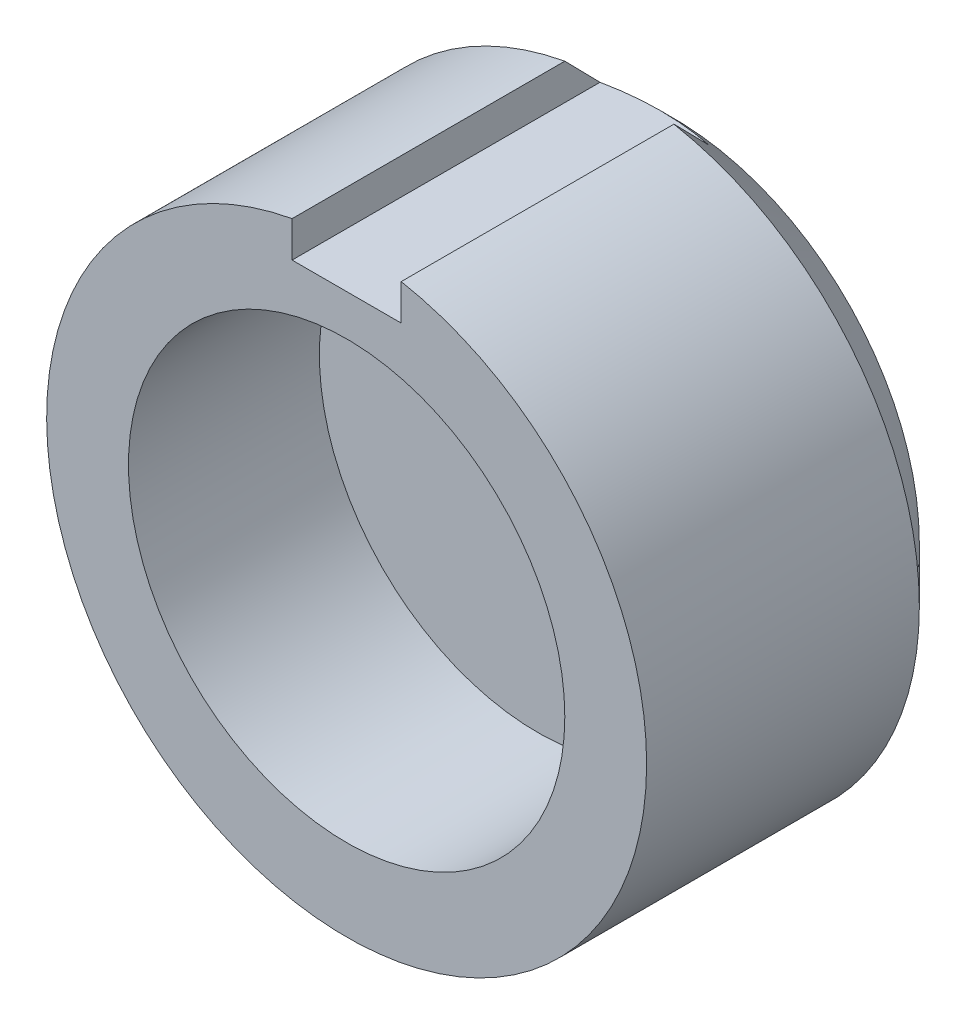
ISO-10303-21;
HEADER;
FILE_DESCRIPTION(('STEP AP214'),'2;1');
FILE_NAME('part.step','',(''),(''),'','','');
FILE_SCHEMA(('AUTOMOTIVE_DESIGN { 1 0 10303 214 1 1 1 1 }'));
ENDSEC;
DATA;
#1=APPLICATION_CONTEXT('core data for automotive mechanical design processes');
#2=APPLICATION_PROTOCOL_DEFINITION('international standard','automotive_design',2000,#1);
#3=PRODUCT_CONTEXT('',#1,'mechanical');
#4=PRODUCT('Part','Part','',(#3));
#5=PRODUCT_RELATED_PRODUCT_CATEGORY('part','',(#4));
#6=PRODUCT_DEFINITION_FORMATION('','',#4);
#7=PRODUCT_DEFINITION_CONTEXT('part definition',#1,'design');
#8=PRODUCT_DEFINITION('design','',#6,#7);
#9=PRODUCT_DEFINITION_SHAPE('','',#8);
#10=(LENGTH_UNIT() NAMED_UNIT(*) SI_UNIT(.MILLI.,.METRE.));
#11=(NAMED_UNIT(*) PLANE_ANGLE_UNIT() SI_UNIT($,.RADIAN.));
#12=(NAMED_UNIT(*) SI_UNIT($,.STERADIAN.) SOLID_ANGLE_UNIT());
#13=UNCERTAINTY_MEASURE_WITH_UNIT(LENGTH_MEASURE(1.E-05),#10,'distance_accuracy_value','');
#14=(GEOMETRIC_REPRESENTATION_CONTEXT(3) GLOBAL_UNCERTAINTY_ASSIGNED_CONTEXT((#13)) GLOBAL_UNIT_ASSIGNED_CONTEXT((#10,
#11,#12)) REPRESENTATION_CONTEXT('',''));
#15=CARTESIAN_POINT('',(0.,0.,0.));
#16=DIRECTION('',(0.,0.,1.));
#17=DIRECTION('',(1.,0.,0.));
#18=AXIS2_PLACEMENT_3D('',#15,#16,#17);
#19=CARTESIAN_POINT('',(0.,0.,12.));
#20=DIRECTION('',(0.,0.,-1.));
#21=DIRECTION('',(-1.,0.,0.));
#22=AXIS2_PLACEMENT_3D('',#19,#20,#21);
#23=CYLINDRICAL_SURFACE('',#22,11.);
#24=CARTESIAN_POINT('',(0.,0.,1.99999999999999));
#25=DIRECTION('',(0.,0.,1.));
#26=DIRECTION('',(1.,0.,0.));
#27=AXIS2_PLACEMENT_3D('',#24,#25,#26);
#28=CIRCLE('',#27,11.);
#29=CARTESIAN_POINT('',(-2.,10.816653826392,2.));
#30=VERTEX_POINT('',#29);
#31=CARTESIAN_POINT('',(2.,10.816653826392,2.));
#32=VERTEX_POINT('',#31);
#33=EDGE_CURVE('E110',#30,#32,#28,.T.);
#34=ORIENTED_EDGE('',*,*,#33,.T.);
#35=DIRECTION('',(0.,0.,-1.));
#36=VECTOR('',#35,1.);
#37=CARTESIAN_POINT('',(2.,10.816653826392,12.));
#38=LINE('',#37,#36);
#39=CARTESIAN_POINT('',(2.,10.816653826392,12.));
#40=VERTEX_POINT('',#39);
#41=EDGE_CURVE('E58',#32,#40,#38,.F.);
#42=ORIENTED_EDGE('',*,*,#41,.T.);
#43=CARTESIAN_POINT('',(0.,0.,12.));
#44=DIRECTION('',(0.,0.,1.));
#45=DIRECTION('',(1.,0.,0.));
#46=AXIS2_PLACEMENT_3D('',#43,#44,#45);
#47=CIRCLE('',#46,11.);
#48=CARTESIAN_POINT('',(-2.,10.816653826392,12.));
#49=VERTEX_POINT('',#48);
#50=EDGE_CURVE('E106',#49,#40,#47,.T.);
#51=ORIENTED_EDGE('',*,*,#50,.F.);
#52=DIRECTION('',(0.,0.,-1.));
#53=VECTOR('',#52,1.);
#54=CARTESIAN_POINT('',(-2.,10.816653826392,12.));
#55=LINE('',#54,#53);
#56=EDGE_CURVE('E88',#49,#30,#55,.T.);
#57=ORIENTED_EDGE('',*,*,#56,.T.);
#58=EDGE_LOOP('',(#34,#42,#51,#57));
#59=FACE_BOUND('',#58,.T.);
#60=ADVANCED_FACE('F31',(#59),#23,.T.);
#61=CARTESIAN_POINT('',(0.,0.,12.));
#62=DIRECTION('',(0.,0.,1.));
#63=DIRECTION('',(1.,0.,0.));
#64=AXIS2_PLACEMENT_3D('',#61,#62,#63);
#65=PLANE('',#64);
#66=DIRECTION('',(0.,1.,0.));
#67=VECTOR('',#66,1.);
#68=CARTESIAN_POINT('',(2.,12.7888938082208,12.));
#69=LINE('',#68,#67);
#70=CARTESIAN_POINT('',(2.,9.5,12.));
#71=VERTEX_POINT('',#70);
#72=EDGE_CURVE('E92',#71,#40,#69,.T.);
#73=ORIENTED_EDGE('',*,*,#72,.F.);
#74=DIRECTION('',(1.,0.,0.));
#75=VECTOR('',#74,1.);
#76=CARTESIAN_POINT('',(2.,9.5,12.));
#77=LINE('',#76,#75);
#78=CARTESIAN_POINT('',(-2.,9.5,12.));
#79=VERTEX_POINT('',#78);
#80=EDGE_CURVE('E78',#79,#71,#77,.T.);
#81=ORIENTED_EDGE('',*,*,#80,.F.);
#82=DIRECTION('',(0.,-1.,0.));
#83=VECTOR('',#82,1.);
#84=CARTESIAN_POINT('',(-2.,12.7888938082208,12.));
#85=LINE('',#84,#83);
#86=EDGE_CURVE('E85',#49,#79,#85,.T.);
#87=ORIENTED_EDGE('',*,*,#86,.F.);
#88=ORIENTED_EDGE('',*,*,#50,.T.);
#89=EDGE_LOOP('',(#73,#81,#87,#88));
#90=FACE_BOUND('',#89,.T.);
#91=CARTESIAN_POINT('',(0.,0.,12.));
#92=DIRECTION('',(0.,0.,1.));
#93=DIRECTION('',(1.,0.,0.));
#94=AXIS2_PLACEMENT_3D('',#91,#92,#93);
#95=CIRCLE('',#94,8.);
#96=CARTESIAN_POINT('',(8.,0.,12.));
#97=VERTEX_POINT('',#96);
#98=EDGE_CURVE('E102',#97,#97,#95,.T.);
#99=ORIENTED_EDGE('',*,*,#98,.F.);
#100=EDGE_LOOP('',(#99));
#101=FACE_BOUND('',#100,.T.);
#102=ADVANCED_FACE('F94',(#90,#101),#65,.T.);
#103=CARTESIAN_POINT('',(0.,0.,0.));
#104=DIRECTION('',(0.,0.,1.));
#105=DIRECTION('',(1.,0.,0.));
#106=AXIS2_PLACEMENT_3D('',#103,#104,#105);
#107=PLANE('',#106);
#108=CARTESIAN_POINT('',(0.,0.,0.));
#109=DIRECTION('',(0.,0.,1.));
#110=DIRECTION('',(1.,0.,0.));
#111=AXIS2_PLACEMENT_3D('',#108,#109,#110);
#112=CIRCLE('',#111,9.);
#113=CARTESIAN_POINT('',(9.,0.,0.));
#114=VERTEX_POINT('',#113);
#115=EDGE_CURVE('E113',#114,#114,#112,.F.);
#116=ORIENTED_EDGE('',*,*,#115,.T.);
#117=EDGE_LOOP('',(#116));
#118=FACE_BOUND('',#117,.T.);
#119=ADVANCED_FACE('F139',(#118),#107,.F.);
#120=CARTESIAN_POINT('',(0.,0.,5.));
#121=DIRECTION('',(0.,0.,1.));
#122=DIRECTION('',(1.,0.,0.));
#123=AXIS2_PLACEMENT_3D('',#120,#121,#122);
#124=CYLINDRICAL_SURFACE('',#123,8.);
#125=CARTESIAN_POINT('',(0.,0.,5.));
#126=DIRECTION('',(0.,0.,1.));
#127=DIRECTION('',(1.,0.,0.));
#128=AXIS2_PLACEMENT_3D('',#125,#126,#127);
#129=CIRCLE('',#128,8.);
#130=CARTESIAN_POINT('',(8.,0.,5.));
#131=VERTEX_POINT('',#130);
#132=EDGE_CURVE('E103',#131,#131,#129,.T.);
#133=ORIENTED_EDGE('',*,*,#132,.F.);
#134=EDGE_LOOP('',(#133));
#135=FACE_BOUND('',#134,.T.);
#136=ORIENTED_EDGE('',*,*,#98,.T.);
#137=EDGE_LOOP('',(#136));
#138=FACE_BOUND('',#137,.T.);
#139=ADVANCED_FACE('F135',(#135,#138),#124,.F.);
#140=CARTESIAN_POINT('',(0.,0.,5.));
#141=DIRECTION('',(0.,0.,1.));
#142=DIRECTION('',(1.,0.,0.));
#143=AXIS2_PLACEMENT_3D('',#140,#141,#142);
#144=PLANE('',#143);
#145=ORIENTED_EDGE('',*,*,#132,.T.);
#146=EDGE_LOOP('',(#145));
#147=FACE_BOUND('',#146,.T.);
#148=ADVANCED_FACE('F132',(#147),#144,.T.);
#149=CARTESIAN_POINT('',(0.,0.,1.99999999999999));
#150=DIRECTION('',(0.,0.,1.));
#151=DIRECTION('',(1.,0.,0.));
#152=AXIS2_PLACEMENT_3D('',#149,#150,#151);
#153=CONICAL_SURFACE('',#152,11.,0.78539816339745);
#154=CARTESIAN_POINT('',(2.,13.0974880511047,4.24930916119143));
#155=CARTESIAN_POINT('',(2.,12.8159307876153,3.97097974284897));
#156=CARTESIAN_POINT('',(2.,12.5342734921716,3.69275160117052));
#157=CARTESIAN_POINT('',(2.,11.9707084676393,3.13654844636593));
#158=CARTESIAN_POINT('',(2.,11.688800738269,2.85857343352535));
#159=CARTESIAN_POINT('',(2.,10.8426369736835,2.02511442373821));
#160=CARTESIAN_POINT('',(2.,10.277930705385,1.47008690273645));
#161=CARTESIAN_POINT('',(2.,9.42941732832977,0.639020349159754));
#162=CARTESIAN_POINT('',(2.,9.14633481760593,0.362241628748049));
#163=CARTESIAN_POINT('',(2.,8.57953184175381,-0.190660827257916));
#164=CARTESIAN_POINT('',(2.,8.29581137800307,-0.466784564263855));
#165=CARTESIAN_POINT('',(2.,7.7275156441118,-1.01816142864535));
#166=CARTESIAN_POINT('',(2.,7.44294035959766,-1.29341454121996));
#167=CARTESIAN_POINT('',(2.,7.01519443835612,-1.70537960091689));
#168=CARTESIAN_POINT('',(2.,6.87246477745528,-1.84254935050856));
#169=CARTESIAN_POINT('',(2.,6.58665006090071,-2.11651862088132));
#170=CARTESIAN_POINT('',(2.,6.44356500451737,-2.25331814090115));
#171=CARTESIAN_POINT('',(2.,6.30027184088472,-2.38989975347991));
#172=B_SPLINE_CURVE_WITH_KNOTS('',3,(#154,#155,#156,#157,#158,#159,#160,#161,#162,#163,#164,
#165,#166,#167,#168,#169,#170,#171),.UNSPECIFIED.,.F.,.F.,(4,2,2,2,2,2,2,2,4),(0.,
1.18771856775746,2.37543847377036,4.75083753595856,5.9385570650255,7.1262740318839,
8.31401108300129,8.90788393417324,9.50175800554577),.UNSPECIFIED.);
#173=CARTESIAN_POINT('',(2.,9.5,0.708243919473798));
#174=VERTEX_POINT('',#173);
#175=EDGE_CURVE('E11',#32,#174,#172,.T.);
#176=ORIENTED_EDGE('',*,*,#175,.F.);
#177=ORIENTED_EDGE('',*,*,#33,.F.);
#178=CARTESIAN_POINT('',(-2.,6.30027184088472,-2.38989975347991));
#179=CARTESIAN_POINT('',(-2.,6.44356500451737,-2.25331814090115));
#180=CARTESIAN_POINT('',(-2.,6.58665006090071,-2.11651862088132));
#181=CARTESIAN_POINT('',(-2.,6.87246477745528,-1.84254935050856));
#182=CARTESIAN_POINT('',(-2.,7.01519443835612,-1.70537960091689));
#183=CARTESIAN_POINT('',(-2.,7.44294035959766,-1.29341454121996));
#184=CARTESIAN_POINT('',(-2.,7.72751564411181,-1.01816142864535));
#185=CARTESIAN_POINT('',(-2.,8.29581137800307,-0.466784564263854));
#186=CARTESIAN_POINT('',(-2.,8.57953184175381,-0.190660827257915));
#187=CARTESIAN_POINT('',(-2.,9.14633481760594,0.362241628748049));
#188=CARTESIAN_POINT('',(-2.,9.42941732832978,0.639020349159754));
#189=CARTESIAN_POINT('',(-2.,10.277930705385,1.47008690273645));
#190=CARTESIAN_POINT('',(-2.,10.8426369736835,2.02511442373821));
#191=CARTESIAN_POINT('',(-2.,11.688800738269,2.85857343352535));
#192=CARTESIAN_POINT('',(-2.,11.9707084676393,3.13654844636593));
#193=CARTESIAN_POINT('',(-2.,12.5342734921716,3.69275160117052));
#194=CARTESIAN_POINT('',(-2.,12.8159307876153,3.97097974284897));
#195=CARTESIAN_POINT('',(-2.,13.0974880511047,4.24930916119143));
#196=B_SPLINE_CURVE_WITH_KNOTS('',3,(#178,#179,#180,#181,#182,#183,#184,#185,#186,#187,#188,
#189,#190,#191,#192,#193,#194,#195),.UNSPECIFIED.,.F.,.F.,(4,2,2,2,2,2,2,2,4),(0.,
0.593874071372526,1.18774692254448,2.37548397366187,3.56320094052027,4.75092046958721,
7.12631953177541,8.3140394377883,9.50175800554577),.UNSPECIFIED.);
#197=CARTESIAN_POINT('',(-2.,9.5,0.708243919473798));
#198=VERTEX_POINT('',#197);
#199=EDGE_CURVE('E116',#198,#30,#196,.T.);
#200=ORIENTED_EDGE('',*,*,#199,.F.);
#201=CARTESIAN_POINT('',(-5.38113015204852,9.5,1.91817575024718));
#202=CARTESIAN_POINT('',(-5.22685160857139,9.5,1.84214516994381));
#203=CARTESIAN_POINT('',(-5.07159937127521,9.5,1.76809601627));
#204=CARTESIAN_POINT('',(-4.75900161160943,9.5,1.62444276859623));
#205=CARTESIAN_POINT('',(-4.60165551328501,9.5,1.5548399295063));
#206=CARTESIAN_POINT('',(-4.12542546984935,9.5,1.35307932593605));
#207=CARTESIAN_POINT('',(-3.80328642988758,9.5,1.22843791410233));
#208=CARTESIAN_POINT('',(-3.15201279527071,9.5,1.00460892365905));
#209=CARTESIAN_POINT('',(-2.82292174222955,9.5,0.905295984900183));
#210=CARTESIAN_POINT('',(-2.15744437537467,9.5,0.736599182284544));
#211=CARTESIAN_POINT('',(-1.82106865439673,9.5,0.66717457198463));
#212=CARTESIAN_POINT('',(-1.24674114783848,9.5,0.578631827967843));
#213=CARTESIAN_POINT('',(-1.01014410886521,9.5,0.55062233619619));
#214=CARTESIAN_POINT('',(-0.535471099976397,9.5,0.512140485204254));
#215=CARTESIAN_POINT('',(-0.297394962049656,9.5,0.501670156219264));
#216=CARTESIAN_POINT('',(0.178839081619706,9.5,0.4986997207023));
#217=CARTESIAN_POINT('',(0.416996972156076,9.5,0.506197209500821));
#218=CARTESIAN_POINT('',(0.892041762003422,9.5,0.53884367836454));
#219=CARTESIAN_POINT('',(1.12892881447049,9.5,0.563990480961212));
#220=CARTESIAN_POINT('',(1.70895932023167,9.5,0.646479892690164));
#221=CARTESIAN_POINT('',(2.05077256092503,9.5,0.713318207347682));
#222=CARTESIAN_POINT('',(2.72710557519324,9.5,0.878213596109495));
#223=CARTESIAN_POINT('',(3.0616139795311,9.5,0.976316077816861));
#224=CARTESIAN_POINT('',(3.72391716333536,9.5,1.19900122700088));
#225=CARTESIAN_POINT('',(4.05165721068185,9.5,1.32374487961077));
#226=CARTESIAN_POINT('',(4.53602799834676,9.5,1.52635441519168));
#227=CARTESIAN_POINT('',(4.69602774575947,9.5,1.59634876891674));
#228=CARTESIAN_POINT('',(5.01385684642412,9.5,1.74098608732262));
#229=CARTESIAN_POINT('',(5.1716868384797,9.5,1.81562764640481));
#230=CARTESIAN_POINT('',(5.32850835513373,9.5,1.89233681496904));
#231=B_SPLINE_CURVE_WITH_KNOTS('',3,(#201,#202,#203,#204,#205,#206,#207,#208,#209,#210,#211,
#212,#213,#214,#215,#216,#217,#218,#219,#220,#221,#222,#223,#224,#225,#226,#227,#228,#229,#230),
.UNSPECIFIED.,.F.,.F.,(4,2,2,2,2,2,2,2,2,2,2,2,2,2,4),(0.,0.515960047261856,1.0320650794441,
2.06741192628774,3.09753040167932,4.12624004577137,4.84039839219381,5.55463939987734,
6.26878482457606,6.98284215769706,8.0258948018208,9.07046931726087,10.1215441383317,
10.6454052526886,11.1691086820388),.UNSPECIFIED.);
#232=EDGE_CURVE('E44',#174,#198,#231,.F.);
#233=ORIENTED_EDGE('',*,*,#232,.F.);
#234=EDGE_LOOP('',(#176,#177,#200,#233));
#235=FACE_BOUND('',#234,.T.);
#236=ORIENTED_EDGE('',*,*,#115,.F.);
#237=EDGE_LOOP('',(#236));
#238=FACE_BOUND('',#237,.T.);
#239=ADVANCED_FACE('F33',(#235,#238),#153,.T.);
#240=CARTESIAN_POINT('',(2.,12.7888938082208,-10.));
#241=DIRECTION('',(1.,0.,0.));
#242=DIRECTION('',(0.,1.,0.));
#243=AXIS2_PLACEMENT_3D('',#240,#241,#242);
#244=PLANE('',#243);
#245=ORIENTED_EDGE('',*,*,#175,.T.);
#246=DIRECTION('',(0.,0.,1.));
#247=VECTOR('',#246,1.);
#248=CARTESIAN_POINT('',(2.,9.5,-10.));
#249=LINE('',#248,#247);
#250=EDGE_CURVE('E82',#174,#71,#249,.T.);
#251=ORIENTED_EDGE('',*,*,#250,.T.);
#252=ORIENTED_EDGE('',*,*,#72,.T.);
#253=ORIENTED_EDGE('',*,*,#41,.F.);
#254=EDGE_LOOP('',(#245,#251,#252,#253));
#255=FACE_BOUND('',#254,.T.);
#256=ADVANCED_FACE('F127',(#255),#244,.F.);
#257=CARTESIAN_POINT('',(-2.,12.7888938082208,-10.));
#258=DIRECTION('',(-1.,0.,0.));
#259=DIRECTION('',(0.,-1.,0.));
#260=AXIS2_PLACEMENT_3D('',#257,#258,#259);
#261=PLANE('',#260);
#262=ORIENTED_EDGE('',*,*,#86,.T.);
#263=DIRECTION('',(0.,0.,1.));
#264=VECTOR('',#263,1.);
#265=CARTESIAN_POINT('',(-2.,9.5,-10.));
#266=LINE('',#265,#264);
#267=EDGE_CURVE('E51',#198,#79,#266,.T.);
#268=ORIENTED_EDGE('',*,*,#267,.F.);
#269=ORIENTED_EDGE('',*,*,#199,.T.);
#270=ORIENTED_EDGE('',*,*,#56,.F.);
#271=EDGE_LOOP('',(#262,#268,#269,#270));
#272=FACE_BOUND('',#271,.T.);
#273=ADVANCED_FACE('F86',(#272),#261,.F.);
#274=CARTESIAN_POINT('',(2.,9.5,-10.));
#275=DIRECTION('',(0.,-1.,0.));
#276=DIRECTION('',(0.,0.,-1.));
#277=AXIS2_PLACEMENT_3D('',#274,#275,#276);
#278=PLANE('',#277);
#279=ORIENTED_EDGE('',*,*,#232,.T.);
#280=ORIENTED_EDGE('',*,*,#267,.T.);
#281=ORIENTED_EDGE('',*,*,#80,.T.);
#282=ORIENTED_EDGE('',*,*,#250,.F.);
#283=EDGE_LOOP('',(#279,#280,#281,#282));
#284=FACE_BOUND('',#283,.T.);
#285=ADVANCED_FACE('F75',(#284),#278,.F.);
#286=CLOSED_SHELL('',(#60,#102,#119,#139,#148,#239,#256,#273,#285));
#287=MANIFOLD_SOLID_BREP('B2',#286);
#288=ADVANCED_BREP_SHAPE_REPRESENTATION('',(#18,#287),#14);
#289=SHAPE_DEFINITION_REPRESENTATION(#9,#288);
ENDSEC;
END-ISO-10303-21;
